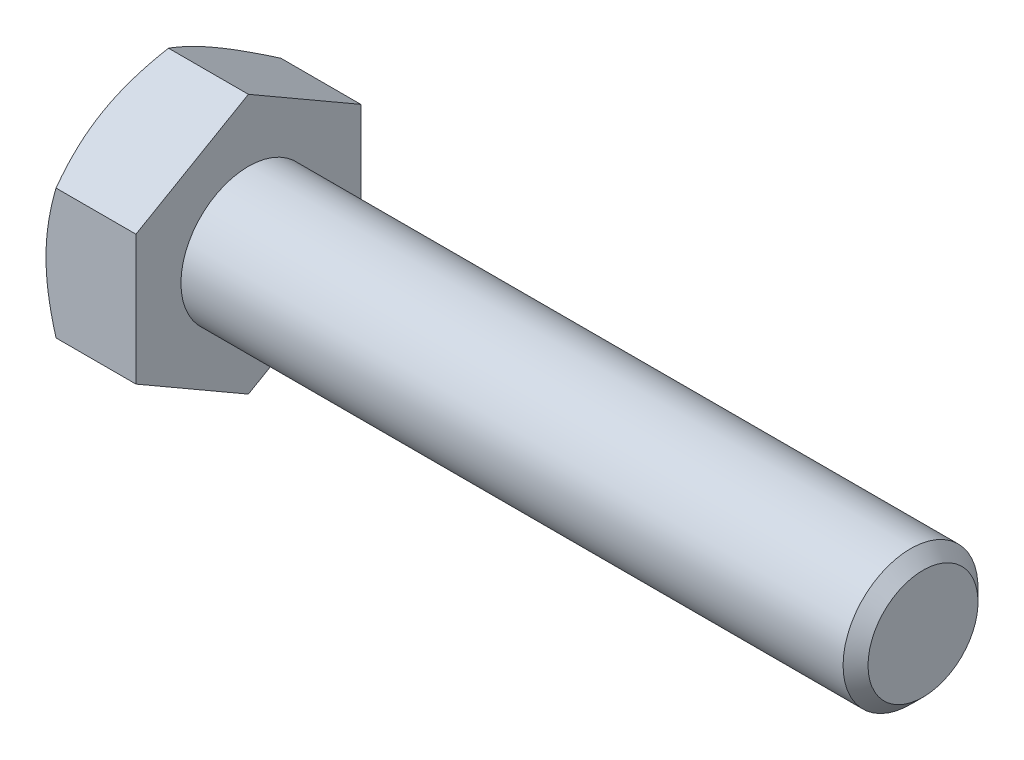
ISO-10303-21;
HEADER;
FILE_DESCRIPTION(('STEP AP214'),'2;1');
FILE_NAME('part.step','',(''),(''),'','','');
FILE_SCHEMA(('AUTOMOTIVE_DESIGN { 1 0 10303 214 1 1 1 1 }'));
ENDSEC;
DATA;
#1=APPLICATION_CONTEXT('core data for automotive mechanical design processes');
#2=APPLICATION_PROTOCOL_DEFINITION('international standard','automotive_design',2000,#1);
#3=PRODUCT_CONTEXT('',#1,'mechanical');
#4=PRODUCT('Part','Part','',(#3));
#5=PRODUCT_RELATED_PRODUCT_CATEGORY('part','',(#4));
#6=PRODUCT_DEFINITION_FORMATION('','',#4);
#7=PRODUCT_DEFINITION_CONTEXT('part definition',#1,'design');
#8=PRODUCT_DEFINITION('design','',#6,#7);
#9=PRODUCT_DEFINITION_SHAPE('','',#8);
#10=(LENGTH_UNIT() NAMED_UNIT(*) SI_UNIT(.MILLI.,.METRE.));
#11=(NAMED_UNIT(*) PLANE_ANGLE_UNIT() SI_UNIT($,.RADIAN.));
#12=(NAMED_UNIT(*) SI_UNIT($,.STERADIAN.) SOLID_ANGLE_UNIT());
#13=UNCERTAINTY_MEASURE_WITH_UNIT(LENGTH_MEASURE(1.E-05),#10,'distance_accuracy_value','');
#14=(GEOMETRIC_REPRESENTATION_CONTEXT(3) GLOBAL_UNCERTAINTY_ASSIGNED_CONTEXT((#13)) GLOBAL_UNIT_ASSIGNED_CONTEXT((#10,
#11,#12)) REPRESENTATION_CONTEXT('',''));
#15=CARTESIAN_POINT('',(0.,0.,0.));
#16=DIRECTION('',(0.,0.,1.));
#17=DIRECTION('',(1.,0.,0.));
#18=AXIS2_PLACEMENT_3D('',#15,#16,#17);
#19=CARTESIAN_POINT('',(4.,2.88675134594812,-5.));
#20=DIRECTION('',(0.,-0.866025403784438,0.500000000000001));
#21=DIRECTION('',(0.,-0.500000000000001,-0.866025403784438));
#22=AXIS2_PLACEMENT_3D('',#19,#20,#21);
#23=PLANE('',#22);
#24=CARTESIAN_POINT('',(0.446648656051831,5.7736181619501,0.000199999999999986));
#25=CARTESIAN_POINT('',(0.373386567637636,5.64675433465071,-0.219534594525184));
#26=CARTESIAN_POINT('',(0.306751321918093,5.5188054379059,-0.44114858445958));
#27=CARTESIAN_POINT('',(0.190438991010812,5.26069210252318,-0.888213995453513));
#28=CARTESIAN_POINT('',(0.14080304991579,5.13052307794721,-1.11367335959077));
#29=CARTESIAN_POINT('',(0.0635510254186987,4.87177839004641,-1.56183230522351));
#30=CARTESIAN_POINT('',(0.0354203782834898,4.74324302208387,-1.78446209310419));
#31=CARTESIAN_POINT('',(0.0101949219536844,4.54998783160116,-2.11918990184664));
#32=CARTESIAN_POINT('',(0.00461345976948374,4.48552534905128,-2.23084219680506));
#33=CARTESIAN_POINT('',(-0.000797783248530163,4.35654081066911,-2.4542499706738));
#34=CARTESIAN_POINT('',(-0.000627741741796996,4.2920187567385,-2.56600544629031));
#35=CARTESIAN_POINT('',(0.0077536317920361,4.11524635305244,-2.87218423085064));
#36=CARTESIAN_POINT('',(0.021829771897251,4.00305457769146,-3.06650608596721));
#37=CARTESIAN_POINT('',(0.06646525710943,3.77941563226457,-3.4538601019977));
#38=CARTESIAN_POINT('',(0.0970398601475071,3.66796924828418,-3.64689090137157));
#39=CARTESIAN_POINT('',(0.173468493621162,3.44387972423144,-4.03502534247485));
#40=CARTESIAN_POINT('',(0.219646378878679,3.3312648659868,-4.23007999864174));
#41=CARTESIAN_POINT('',(0.324451794491933,3.1077146415794,-4.61728034535877));
#42=CARTESIAN_POINT('',(0.383054703437373,2.99677641204846,-4.80943099540809));
#43=CARTESIAN_POINT('',(0.446648656051827,2.88663587589429,-5.0002));
#44=B_SPLINE_CURVE_WITH_KNOTS('',3,(#24,#25,#26,#27,#28,#29,#30,#31,#32,#33,#34,#35,#36,#37,#38,
#39,#40,#41,#42,#43),.UNSPECIFIED.,.F.,.F.,(4,2,2,2,2,2,2,2,2,4),(0.,0.792555841363091,
1.58701660053334,2.36181537487281,2.74884076077326,3.13585419177295,3.80962362599679,
4.48401723901189,5.17336882348929,5.86136694793726),.UNSPECIFIED.);
#45=CARTESIAN_POINT('',(0.446581987385204,5.77350269189626,0.));
#46=VERTEX_POINT('',#45);
#47=CARTESIAN_POINT('',(0.,4.33012701892219,-2.50000000000001));
#48=VERTEX_POINT('',#47);
#49=EDGE_CURVE('E52',#46,#48,#44,.T.);
#50=ORIENTED_EDGE('',*,*,#49,.F.);
#51=DIRECTION('',(-1.,0.,0.));
#52=VECTOR('',#51,1.);
#53=CARTESIAN_POINT('',(4.,5.77350269189626,0.));
#54=LINE('',#53,#52);
#55=CARTESIAN_POINT('',(4.,5.77350269189626,0.));
#56=VERTEX_POINT('',#55);
#57=EDGE_CURVE('E148',#56,#46,#54,.T.);
#58=ORIENTED_EDGE('',*,*,#57,.F.);
#59=DIRECTION('',(0.,0.500000000000001,0.866025403784438));
#60=VECTOR('',#59,1.);
#61=CARTESIAN_POINT('',(4.,2.88675134594812,-5.));
#62=LINE('',#61,#60);
#63=CARTESIAN_POINT('',(4.,2.88675134594812,-5.));
#64=VERTEX_POINT('',#63);
#65=EDGE_CURVE('E233',#64,#56,#62,.T.);
#66=ORIENTED_EDGE('',*,*,#65,.F.);
#67=DIRECTION('',(-1.,0.,0.));
#68=VECTOR('',#67,1.);
#69=CARTESIAN_POINT('',(4.,2.88675134594812,-5.));
#70=LINE('',#69,#68);
#71=CARTESIAN_POINT('',(0.4465819873852,2.88675134594812,-5.));
#72=VERTEX_POINT('',#71);
#73=EDGE_CURVE('E136',#64,#72,#70,.T.);
#74=ORIENTED_EDGE('',*,*,#73,.T.);
#75=EDGE_CURVE('E130',#48,#72,#44,.T.);
#76=ORIENTED_EDGE('',*,*,#75,.F.);
#77=EDGE_LOOP('',(#50,#58,#66,#74,#76));
#78=FACE_BOUND('',#77,.T.);
#79=ADVANCED_FACE('F36',(#78),#23,.F.);
#80=CARTESIAN_POINT('',(4.,5.77350269189626,0.));
#81=DIRECTION('',(0.,-0.866025403784438,-0.500000000000001));
#82=DIRECTION('',(0.,0.500000000000001,-0.866025403784438));
#83=AXIS2_PLACEMENT_3D('',#80,#81,#82);
#84=PLANE('',#83);
#85=CARTESIAN_POINT('',(0.446648656051828,2.88663587589429,5.0002));
#86=CARTESIAN_POINT('',(0.373386567637634,3.01349970319368,4.78046540547482));
#87=CARTESIAN_POINT('',(0.306751321918091,3.14144859993849,4.55885141554042));
#88=CARTESIAN_POINT('',(0.19043899101081,3.3995619353212,4.11178600454649));
#89=CARTESIAN_POINT('',(0.140803049915789,3.52973095989717,3.88632664040923));
#90=CARTESIAN_POINT('',(0.0635510254186978,3.78847564779797,3.43816769477649));
#91=CARTESIAN_POINT('',(0.0354203782834894,3.91701101576052,3.21553790689581));
#92=CARTESIAN_POINT('',(0.0101949219536847,4.11026620624322,2.88081009815336));
#93=CARTESIAN_POINT('',(0.00461345976948418,4.17472868879311,2.76915780319494));
#94=CARTESIAN_POINT('',(-0.000797783248529596,4.30371322717528,2.5457500293262));
#95=CARTESIAN_POINT('',(-0.000627741741796505,4.36823528110589,2.43399455370969));
#96=CARTESIAN_POINT('',(0.00775363179203663,4.54500768479194,2.12781576914936));
#97=CARTESIAN_POINT('',(0.0218297718972519,4.65719946015293,1.93349391403279));
#98=CARTESIAN_POINT('',(0.0664652571094317,4.88083840557981,1.5461398980023));
#99=CARTESIAN_POINT('',(0.0970398601475093,4.9922847895602,1.35310909862843));
#100=CARTESIAN_POINT('',(0.173468493621165,5.21637431361295,0.964974657525146));
#101=CARTESIAN_POINT('',(0.219646378878682,5.32898917185759,0.769920001358265));
#102=CARTESIAN_POINT('',(0.324451794491936,5.55253939626498,0.382719654641232));
#103=CARTESIAN_POINT('',(0.383054703437376,5.66347762579592,0.190569004591913));
#104=CARTESIAN_POINT('',(0.446648656051831,5.7736181619501,-0.000200000000000144));
#105=B_SPLINE_CURVE_WITH_KNOTS('',3,(#85,#86,#87,#88,#89,#90,#91,#92,#93,#94,#95,#96,#97,#98,
#99,#100,#101,#102,#103,#104),.UNSPECIFIED.,.F.,.F.,(4,2,2,2,2,2,2,2,2,4),(0.,0.792555841363091,
1.58701660053333,2.36181537487281,2.74884076077325,3.13585419177295,3.80962362599679,
4.48401723901189,5.17336882348929,5.86136694793726),.UNSPECIFIED.);
#106=CARTESIAN_POINT('',(0.446581987385201,2.88675134594812,5.));
#107=VERTEX_POINT('',#106);
#108=CARTESIAN_POINT('',(0.,4.33012701892219,2.5));
#109=VERTEX_POINT('',#108);
#110=EDGE_CURVE('E59',#107,#109,#105,.T.);
#111=ORIENTED_EDGE('',*,*,#110,.F.);
#112=DIRECTION('',(-1.,0.,0.));
#113=VECTOR('',#112,1.);
#114=CARTESIAN_POINT('',(4.,2.88675134594813,5.));
#115=LINE('',#114,#113);
#116=CARTESIAN_POINT('',(4.,2.88675134594813,5.));
#117=VERTEX_POINT('',#116);
#118=EDGE_CURVE('E146',#117,#107,#115,.T.);
#119=ORIENTED_EDGE('',*,*,#118,.F.);
#120=DIRECTION('',(0.,-0.500000000000001,0.866025403784438));
#121=VECTOR('',#120,1.);
#122=CARTESIAN_POINT('',(4.,5.77350269189626,0.));
#123=LINE('',#122,#121);
#124=EDGE_CURVE('E231',#56,#117,#123,.T.);
#125=ORIENTED_EDGE('',*,*,#124,.F.);
#126=ORIENTED_EDGE('',*,*,#57,.T.);
#127=EDGE_CURVE('E163',#109,#46,#105,.T.);
#128=ORIENTED_EDGE('',*,*,#127,.F.);
#129=EDGE_LOOP('',(#111,#119,#125,#126,#128));
#130=FACE_BOUND('',#129,.T.);
#131=ADVANCED_FACE('F169',(#130),#84,.F.);
#132=CARTESIAN_POINT('',(4.,2.88675134594813,5.));
#133=DIRECTION('',(0.,0.,-1.));
#134=DIRECTION('',(0.,1.,0.));
#135=AXIS2_PLACEMENT_3D('',#132,#133,#134);
#136=PLANE('',#135);
#137=CARTESIAN_POINT('',(2.47533544689295,-7.82661640313889,5.));
#138=CARTESIAN_POINT('',(2.36879683507773,-7.60758613024921,5.));
#139=CARTESIAN_POINT('',(2.26325911833056,-7.3880607136441,5.));
#140=CARTESIAN_POINT('',(2.0547470786595,-6.94775649535433,5.));
#141=CARTESIAN_POINT('',(1.95177314617002,-6.72697750897688,5.));
#142=CARTESIAN_POINT('',(1.74844778545274,-6.28280027125597,5.));
#143=CARTESIAN_POINT('',(1.64811306490869,-6.05939434592713,5.));
#144=CARTESIAN_POINT('',(1.45145486004312,-5.6108304383292,5.));
#145=CARTESIAN_POINT('',(1.35513119080617,-5.38567253739804,5.));
#146=CARTESIAN_POINT('',(1.1644503760596,-4.92576614780202,5.));
#147=CARTESIAN_POINT('',(1.07026351405995,-4.69094667859484,5.));
#148=CARTESIAN_POINT('',(0.888844387350835,-4.21858752735362,5.));
#149=CARTESIAN_POINT('',(0.801612892640657,-3.98104754746317,5.));
#150=CARTESIAN_POINT('',(0.636341071883238,-3.50329086404363,5.));
#151=CARTESIAN_POINT('',(0.558282765149709,-3.26308044250486,5.));
#152=CARTESIAN_POINT('',(0.413813856737663,-2.77921467819531,5.));
#153=CARTESIAN_POINT('',(0.347399663631973,-2.53556042275999,5.));
#154=CARTESIAN_POINT('',(0.22970745053505,-2.04600448312503,5.));
#155=CARTESIAN_POINT('',(0.178346573442477,-1.80012308686183,5.));
#156=CARTESIAN_POINT('',(0.0936230804935142,-1.30522837494365,5.));
#157=CARTESIAN_POINT('',(0.0602585789244918,-1.05621539022477,5.));
#158=CARTESIAN_POINT('',(0.0146229933804843,-0.559584253783065,5.));
#159=CARTESIAN_POINT('',(0.00207498506584115,-0.311992192967673,5.));
#160=CARTESIAN_POINT('',(-0.0015974716503048,0.18337558405674,5.));
#161=CARTESIAN_POINT('',(0.00727849448086283,0.431151303726643,5.));
#162=CARTESIAN_POINT('',(0.0397265053205848,0.84962286075823,5.));
#163=CARTESIAN_POINT('',(0.0579847912618802,1.02075746544157,5.));
#164=CARTESIAN_POINT('',(0.103624049996723,1.3618139875752,5.));
#165=CARTESIAN_POINT('',(0.131006199082925,1.53173574577271,5.));
#166=CARTESIAN_POINT('',(0.225403333816323,2.03942834541587,5.));
#167=CARTESIAN_POINT('',(0.304653621104038,2.37495177168563,5.));
#168=CARTESIAN_POINT('',(0.442611792168641,2.87686006020152,5.));
#169=CARTESIAN_POINT('',(0.492453035928118,3.04583048582565,5.));
#170=CARTESIAN_POINT('',(0.597441969480142,3.38213061038659,5.));
#171=CARTESIAN_POINT('',(0.652589698776807,3.54946029709869,5.));
#172=CARTESIAN_POINT('',(0.767295730006399,3.88253122341817,5.));
#173=CARTESIAN_POINT('',(0.826852713137817,4.04827292137365,5.));
#174=CARTESIAN_POINT('',(0.949663499110053,4.37837269604184,5.));
#175=CARTESIAN_POINT('',(1.01291722636637,4.54273080096526,5.));
#176=CARTESIAN_POINT('',(1.18384085306905,4.9746759403977,5.));
#177=CARTESIAN_POINT('',(1.29410564783453,5.24123504256648,5.));
#178=CARTESIAN_POINT('',(1.52085041203993,5.77170603526334,5.));
#179=CARTESIAN_POINT('',(1.63733099805397,6.03561766007928,5.));
#180=CARTESIAN_POINT('',(1.87507624393349,6.56138078778337,5.));
#181=CARTESIAN_POINT('',(1.99634255328238,6.82323154239329,5.));
#182=CARTESIAN_POINT('',(2.24254703861693,7.34518395602015,5.));
#183=CARTESIAN_POINT('',(2.36748508200602,7.60528567778374,5.));
#184=CARTESIAN_POINT('',(2.62044102887898,8.12446478659922,5.));
#185=CARTESIAN_POINT('',(2.74846325062126,8.38354006552432,5.));
#186=CARTESIAN_POINT('',(3.00682668967549,8.9005329112754,5.));
#187=CARTESIAN_POINT('',(3.13716793074432,9.15845046620729,5.));
#188=CARTESIAN_POINT('',(3.53092424591317,9.93067662274979,5.));
#189=CARTESIAN_POINT('',(3.79712405172275,10.4435647238032,5.));
#190=CARTESIAN_POINT('',(4.3072404688117,11.4147548711532,5.));
#191=CARTESIAN_POINT('',(4.55067498762245,11.873311348306,5.));
#192=CARTESIAN_POINT('',(5.04052915785298,12.7888590468283,5.));
#193=CARTESIAN_POINT('',(5.28694897482743,13.2458501795696,5.));
#194=CARTESIAN_POINT('',(5.78122505346439,14.1571829390173,5.));
#195=CARTESIAN_POINT('',(6.02907430461245,14.6115283739736,5.));
#196=CARTESIAN_POINT('',(6.5264818551985,15.5192398746589,5.));
#197=CARTESIAN_POINT('',(6.77604002809907,15.9726060096992,5.));
#198=CARTESIAN_POINT('',(7.02622264559118,16.4256251044156,5.00000000000001));
#199=B_SPLINE_CURVE_WITH_KNOTS('',3,(#137,#138,#139,#140,#141,#142,#143,#144,#145,#146,#147,
#148,#149,#150,#151,#152,#153,#154,#155,#156,#157,#158,#159,#160,#161,#162,#163,#164,#165,#166,
#167,#168,#169,#170,#171,#172,#173,#174,#175,#176,#177,#178,#179,#180,#181,#182,#183,#184,#185,
#186,#187,#188,#189,#190,#191,#192,#193,#194,#195,#196,#197,#198),.UNSPECIFIED.,.F.,.F.,(4,2,2,
2,2,2,2,2,2,2,2,2,2,2,2,2,2,2,2,2,2,2,2,2,2,2,2,2,2,2,4),(0.,0.730708682143098,1.46152797033751,
2.19620403652928,2.930846195478,3.68977491658213,4.44878753915767,5.20628666210828,
5.9635517348485,6.71656679485872,7.46950293642267,8.21233991237299,8.95519126159773,
9.47125991232469,9.98739512288342,11.0201893937443,11.5486465414698,12.0771076235976,
12.6054112774226,13.1337041332035,13.9989833719716,14.8643486020619,15.7300147459346,
16.5956496665091,17.4625765068272,18.3295122333794,20.0630293163822,21.6205191219182,
23.1780956996636,24.7307447704824,26.2832800921358),.UNSPECIFIED.);
#200=CARTESIAN_POINT('',(0.446581987385199,-2.88675134594812,5.));
#201=VERTEX_POINT('',#200);
#202=CARTESIAN_POINT('',(0.,0.,5.));
#203=VERTEX_POINT('',#202);
#204=EDGE_CURVE('E243',#201,#203,#199,.T.);
#205=ORIENTED_EDGE('',*,*,#204,.F.);
#206=DIRECTION('',(-1.,0.,0.));
#207=VECTOR('',#206,1.);
#208=CARTESIAN_POINT('',(4.,-2.88675134594812,5.));
#209=LINE('',#208,#207);
#210=CARTESIAN_POINT('',(4.,-2.88675134594812,5.));
#211=VERTEX_POINT('',#210);
#212=EDGE_CURVE('E138',#211,#201,#209,.T.);
#213=ORIENTED_EDGE('',*,*,#212,.F.);
#214=DIRECTION('',(0.,-1.,0.));
#215=VECTOR('',#214,1.);
#216=CARTESIAN_POINT('',(4.,2.88675134594813,5.));
#217=LINE('',#216,#215);
#218=EDGE_CURVE('E227',#117,#211,#217,.T.);
#219=ORIENTED_EDGE('',*,*,#218,.F.);
#220=ORIENTED_EDGE('',*,*,#118,.T.);
#221=EDGE_CURVE('E185',#203,#107,#199,.T.);
#222=ORIENTED_EDGE('',*,*,#221,.F.);
#223=EDGE_LOOP('',(#205,#213,#219,#220,#222));
#224=FACE_BOUND('',#223,.T.);
#225=ADVANCED_FACE('F249',(#224),#136,.F.);
#226=CARTESIAN_POINT('',(4.,-5.77350269189626,0.));
#227=DIRECTION('',(0.,0.866025403784438,-0.500000000000002));
#228=DIRECTION('',(0.,0.500000000000002,0.866025403784437));
#229=AXIS2_PLACEMENT_3D('',#226,#227,#228);
#230=PLANE('',#229);
#231=CARTESIAN_POINT('',(0.446648656051832,-5.7736181619501,-0.000200000000000053));
#232=CARTESIAN_POINT('',(0.373386567637638,-5.64675433465071,0.219534594525185));
#233=CARTESIAN_POINT('',(0.306751321918095,-5.5188054379059,0.441148584459581));
#234=CARTESIAN_POINT('',(0.190438991010813,-5.26069210252318,0.888213995453513));
#235=CARTESIAN_POINT('',(0.140803049915791,-5.13052307794721,1.11367335959077));
#236=CARTESIAN_POINT('',(0.063551025418699,-4.87177839004641,1.56183230522351));
#237=CARTESIAN_POINT('',(0.03542037828349,-4.74324302208387,1.78446209310419));
#238=CARTESIAN_POINT('',(0.0101949219536843,-4.54998783160116,2.11918990184664));
#239=CARTESIAN_POINT('',(0.00461345976948345,-4.48552534905128,2.23084219680506));
#240=CARTESIAN_POINT('',(-0.000797783248530365,-4.35654081066911,2.4542499706738));
#241=CARTESIAN_POINT('',(-0.000627741741796937,-4.2920187567385,2.56600544629031));
#242=CARTESIAN_POINT('',(0.00775363179203635,-4.11524635305244,2.87218423085064));
#243=CARTESIAN_POINT('',(0.0218297718972508,-4.00305457769146,3.06650608596721));
#244=CARTESIAN_POINT('',(0.0664652571094294,-3.77941563226457,3.4538601019977));
#245=CARTESIAN_POINT('',(0.0970398601475065,-3.66796924828418,3.64689090137157));
#246=CARTESIAN_POINT('',(0.173468493621162,-3.44387972423143,4.03502534247485));
#247=CARTESIAN_POINT('',(0.219646378878678,-3.33126486598679,4.23007999864174));
#248=CARTESIAN_POINT('',(0.324451794491932,-3.1077146415794,4.61728034535877));
#249=CARTESIAN_POINT('',(0.383054703437371,-2.99677641204846,4.80943099540809));
#250=CARTESIAN_POINT('',(0.446648656051825,-2.88663587589428,5.0002));
#251=B_SPLINE_CURVE_WITH_KNOTS('',3,(#231,#232,#233,#234,#235,#236,#237,#238,#239,#240,#241,
#242,#243,#244,#245,#246,#247,#248,#249,#250),.UNSPECIFIED.,.F.,.F.,(4,2,2,2,2,2,2,2,2,4),(0.,
0.792555841363092,1.58701660053334,2.36181537487281,2.74884076077326,3.13585419177295,
3.8096236259968,4.4840172390119,5.17336882348929,5.86136694793726),.UNSPECIFIED.);
#252=CARTESIAN_POINT('',(0.446581987385206,-5.77350269189626,0.));
#253=VERTEX_POINT('',#252);
#254=CARTESIAN_POINT('',(0.,-4.33012701892219,2.50000000000001));
#255=VERTEX_POINT('',#254);
#256=EDGE_CURVE('E171',#253,#255,#251,.T.);
#257=ORIENTED_EDGE('',*,*,#256,.F.);
#258=DIRECTION('',(-1.,0.,0.));
#259=VECTOR('',#258,1.);
#260=CARTESIAN_POINT('',(4.,-5.77350269189626,0.));
#261=LINE('',#260,#259);
#262=CARTESIAN_POINT('',(4.,-5.77350269189626,0.));
#263=VERTEX_POINT('',#262);
#264=EDGE_CURVE('E135',#263,#253,#261,.T.);
#265=ORIENTED_EDGE('',*,*,#264,.F.);
#266=DIRECTION('',(0.,-0.500000000000002,-0.866025403784437));
#267=VECTOR('',#266,1.);
#268=CARTESIAN_POINT('',(4.,-5.77350269189626,0.));
#269=LINE('',#268,#267);
#270=EDGE_CURVE('E225',#211,#263,#269,.T.);
#271=ORIENTED_EDGE('',*,*,#270,.F.);
#272=ORIENTED_EDGE('',*,*,#212,.T.);
#273=EDGE_CURVE('E173',#255,#201,#251,.T.);
#274=ORIENTED_EDGE('',*,*,#273,.F.);
#275=EDGE_LOOP('',(#257,#265,#271,#272,#274));
#276=FACE_BOUND('',#275,.T.);
#277=ADVANCED_FACE('F221',(#276),#230,.F.);
#278=CARTESIAN_POINT('',(4.,-2.88675134594813,-5.));
#279=DIRECTION('',(0.,0.866025403784439,0.5));
#280=DIRECTION('',(0.,-0.5,0.866025403784439));
#281=AXIS2_PLACEMENT_3D('',#278,#279,#280);
#282=PLANE('',#281);
#283=CARTESIAN_POINT('',(0.44664865605183,-2.8866358758943,-5.0002));
#284=CARTESIAN_POINT('',(0.373386567637636,-3.01349970319369,-4.78046540547482));
#285=CARTESIAN_POINT('',(0.306751321918093,-3.1414485999385,-4.55885141554042));
#286=CARTESIAN_POINT('',(0.190438991010813,-3.39956193532121,-4.11178600454649));
#287=CARTESIAN_POINT('',(0.140803049915791,-3.52973095989718,-3.88632664040923));
#288=CARTESIAN_POINT('',(0.0635510254187004,-3.78847564779798,-3.43816769477649));
#289=CARTESIAN_POINT('',(0.0354203782834919,-3.91701101576052,-3.21553790689581));
#290=CARTESIAN_POINT('',(0.0101949219536874,-4.11026620624323,-2.88081009815336));
#291=CARTESIAN_POINT('',(0.00461345976948698,-4.17472868879311,-2.76915780319494));
#292=CARTESIAN_POINT('',(-0.000797783248526409,-4.30371322717528,-2.5457500293262));
#293=CARTESIAN_POINT('',(-0.000627741741793026,-4.36823528110589,-2.43399455370968));
#294=CARTESIAN_POINT('',(0.0077536317920405,-4.54500768479195,-2.12781576914936));
#295=CARTESIAN_POINT('',(0.0218297718972554,-4.65719946015293,-1.93349391403278));
#296=CARTESIAN_POINT('',(0.0664652571094348,-4.88083840557982,-1.54613989800229));
#297=CARTESIAN_POINT('',(0.0970398601475121,-4.99228478956021,-1.35310909862843));
#298=CARTESIAN_POINT('',(0.173468493621168,-5.21637431361295,-0.964974657525145));
#299=CARTESIAN_POINT('',(0.219646378878684,-5.32898917185759,-0.769920001358263));
#300=CARTESIAN_POINT('',(0.324451794491938,-5.55253939626499,-0.382719654641231));
#301=CARTESIAN_POINT('',(0.383054703437378,-5.66347762579592,-0.190569004591913));
#302=CARTESIAN_POINT('',(0.446648656051832,-5.7736181619501,0.000200000000000639));
#303=B_SPLINE_CURVE_WITH_KNOTS('',3,(#283,#284,#285,#286,#287,#288,#289,#290,#291,#292,#293,
#294,#295,#296,#297,#298,#299,#300,#301,#302),.UNSPECIFIED.,.F.,.F.,(4,2,2,2,2,2,2,2,2,4),(0.,
0.79255584136309,1.58701660053333,2.36181537487281,2.74884076077325,3.13585419177295,
3.80962362599679,4.48401723901189,5.17336882348929,5.86136694793725),.UNSPECIFIED.);
#304=CARTESIAN_POINT('',(0.446581987384949,-2.88675134594852,-5.));
#305=VERTEX_POINT('',#304);
#306=CARTESIAN_POINT('',(0.,-4.33012701892219,-2.5));
#307=VERTEX_POINT('',#306);
#308=EDGE_CURVE('E112',#305,#307,#303,.T.);
#309=ORIENTED_EDGE('',*,*,#308,.F.);
#310=DIRECTION('',(-1.,0.,0.));
#311=VECTOR('',#310,1.);
#312=CARTESIAN_POINT('',(4.,-2.88675134594813,-5.));
#313=LINE('',#312,#311);
#314=CARTESIAN_POINT('',(4.,-2.88675134594813,-5.));
#315=VERTEX_POINT('',#314);
#316=EDGE_CURVE('E126',#315,#305,#313,.T.);
#317=ORIENTED_EDGE('',*,*,#316,.F.);
#318=DIRECTION('',(0.,0.5,-0.866025403784439));
#319=VECTOR('',#318,1.);
#320=CARTESIAN_POINT('',(4.,-2.88675134594813,-5.));
#321=LINE('',#320,#319);
#322=EDGE_CURVE('E223',#263,#315,#321,.T.);
#323=ORIENTED_EDGE('',*,*,#322,.F.);
#324=ORIENTED_EDGE('',*,*,#264,.T.);
#325=EDGE_CURVE('E129',#307,#253,#303,.T.);
#326=ORIENTED_EDGE('',*,*,#325,.F.);
#327=EDGE_LOOP('',(#309,#317,#323,#324,#326));
#328=FACE_BOUND('',#327,.T.);
#329=ADVANCED_FACE('F124',(#328),#282,.F.);
#330=CARTESIAN_POINT('',(4.,2.88675134594812,-5.));
#331=DIRECTION('',(0.,0.,1.));
#332=DIRECTION('',(1.,0.,0.));
#333=AXIS2_PLACEMENT_3D('',#330,#331,#332);
#334=PLANE('',#333);
#335=CARTESIAN_POINT('',(2.47533544689296,-7.82661640313891,-5.));
#336=CARTESIAN_POINT('',(2.36879683507773,-7.60758613024923,-5.));
#337=CARTESIAN_POINT('',(2.26325911833057,-7.38806071364412,-5.));
#338=CARTESIAN_POINT('',(2.05474707865951,-6.94775649535435,-5.));
#339=CARTESIAN_POINT('',(1.95177314617003,-6.7269775089769,-5.));
#340=CARTESIAN_POINT('',(1.74844778545275,-6.28280027125599,-5.));
#341=CARTESIAN_POINT('',(1.64811306490869,-6.05939434592714,-5.));
#342=CARTESIAN_POINT('',(1.45145486004312,-5.61083043832922,-5.));
#343=CARTESIAN_POINT('',(1.35513119080618,-5.38567253739806,-5.));
#344=CARTESIAN_POINT('',(1.16445037605961,-4.92576614780204,-5.));
#345=CARTESIAN_POINT('',(1.07026351405996,-4.69094667859486,-5.));
#346=CARTESIAN_POINT('',(0.888844387350842,-4.21858752735364,-5.));
#347=CARTESIAN_POINT('',(0.801612892640663,-3.98104754746318,-5.));
#348=CARTESIAN_POINT('',(0.636341071883243,-3.50329086404365,-5.));
#349=CARTESIAN_POINT('',(0.558282765149714,-3.26308044250488,-5.));
#350=CARTESIAN_POINT('',(0.413813856737668,-2.77921467819533,-5.));
#351=CARTESIAN_POINT('',(0.347399663631977,-2.53556042276,-5.));
#352=CARTESIAN_POINT('',(0.229707450535054,-2.04600448312504,-5.));
#353=CARTESIAN_POINT('',(0.178346573442481,-1.80012308686184,-5.));
#354=CARTESIAN_POINT('',(0.0936230804935165,-1.30522837494366,-5.));
#355=CARTESIAN_POINT('',(0.0602585789244934,-1.05621539022478,-5.));
#356=CARTESIAN_POINT('',(0.014622993380485,-0.559584253783075,-5.));
#357=CARTESIAN_POINT('',(0.0020749850658414,-0.311992192967682,-5.));
#358=CARTESIAN_POINT('',(-0.00159747165030502,0.183375584056731,-5.));
#359=CARTESIAN_POINT('',(0.00727849448086254,0.431151303726634,-5.));
#360=CARTESIAN_POINT('',(0.0397265053205839,0.849622860758221,-5.));
#361=CARTESIAN_POINT('',(0.0579847912618789,1.02075746544156,-5.));
#362=CARTESIAN_POINT('',(0.103624049996721,1.36181398757519,-5.));
#363=CARTESIAN_POINT('',(0.131006199082923,1.5317357457727,-5.));
#364=CARTESIAN_POINT('',(0.225403333816321,2.03942834541586,-5.));
#365=CARTESIAN_POINT('',(0.304653621104034,2.37495177168562,-5.));
#366=CARTESIAN_POINT('',(0.442611792168636,2.87686006020151,-5.));
#367=CARTESIAN_POINT('',(0.492453035928113,3.04583048582564,-5.));
#368=CARTESIAN_POINT('',(0.597441969480137,3.38213061038658,-5.));
#369=CARTESIAN_POINT('',(0.652589698776802,3.54946029709868,-5.));
#370=CARTESIAN_POINT('',(0.767295730006393,3.88253122341816,-5.));
#371=CARTESIAN_POINT('',(0.826852713137811,4.04827292137363,-5.));
#372=CARTESIAN_POINT('',(0.949663499110047,4.37837269604182,-5.));
#373=CARTESIAN_POINT('',(1.01291722636637,4.54273080096525,-5.));
#374=CARTESIAN_POINT('',(1.18384085306905,4.97467594039768,-5.));
#375=CARTESIAN_POINT('',(1.29410564783452,5.24123504256647,-5.));
#376=CARTESIAN_POINT('',(1.52085041203992,5.77170603526333,-5.));
#377=CARTESIAN_POINT('',(1.63733099805396,6.03561766007927,-5.));
#378=CARTESIAN_POINT('',(1.87507624393348,6.56138078778336,-5.));
#379=CARTESIAN_POINT('',(1.99634255328237,6.82323154239328,-5.));
#380=CARTESIAN_POINT('',(2.24254703861692,7.34518395602014,-5.));
#381=CARTESIAN_POINT('',(2.36748508200601,7.60528567778373,-5.));
#382=CARTESIAN_POINT('',(2.62044102887897,8.12446478659921,-5.));
#383=CARTESIAN_POINT('',(2.74846325062125,8.38354006552432,-5.));
#384=CARTESIAN_POINT('',(3.00682668967549,8.9005329112754,-5.));
#385=CARTESIAN_POINT('',(3.13716793074432,9.15845046620728,-5.));
#386=CARTESIAN_POINT('',(3.53092424591316,9.93067662274979,-5.));
#387=CARTESIAN_POINT('',(3.79712405172275,10.4435647238032,-5.));
#388=CARTESIAN_POINT('',(4.3072404688117,11.4147548711532,-5.));
#389=CARTESIAN_POINT('',(4.55067498762245,11.873311348306,-5.));
#390=CARTESIAN_POINT('',(5.04052915785298,12.7888590468283,-5.));
#391=CARTESIAN_POINT('',(5.28694897482743,13.2458501795696,-5.));
#392=CARTESIAN_POINT('',(5.7812250534644,14.1571829390173,-5.));
#393=CARTESIAN_POINT('',(6.02907430461245,14.6115283739736,-5.));
#394=CARTESIAN_POINT('',(6.5264818551985,15.5192398746589,-5.));
#395=CARTESIAN_POINT('',(6.77604002809907,15.9726060096992,-5.));
#396=CARTESIAN_POINT('',(7.02622264559118,16.4256251044156,-5.));
#397=B_SPLINE_CURVE_WITH_KNOTS('',3,(#335,#336,#337,#338,#339,#340,#341,#342,#343,#344,#345,
#346,#347,#348,#349,#350,#351,#352,#353,#354,#355,#356,#357,#358,#359,#360,#361,#362,#363,#364,
#365,#366,#367,#368,#369,#370,#371,#372,#373,#374,#375,#376,#377,#378,#379,#380,#381,#382,#383,
#384,#385,#386,#387,#388,#389,#390,#391,#392,#393,#394,#395,#396),.UNSPECIFIED.,.F.,.F.,(4,2,2,
2,2,2,2,2,2,2,2,2,2,2,2,2,2,2,2,2,2,2,2,2,2,2,2,2,2,2,4),(0.,0.730708682143099,1.46152797033751,
2.19620403652929,2.930846195478,3.68977491658213,4.44878753915767,5.20628666210828,
5.9635517348485,6.71656679485873,7.46950293642268,8.21233991237301,8.95519126159775,
9.4712599123247,9.98739512288343,11.0201893937443,11.5486465414698,12.0771076235976,
12.6054112774226,13.1337041332035,13.9989833719716,14.8643486020619,15.7300147459346,
16.5956496665091,17.4625765068272,18.3295122333794,20.0630293163822,21.6205191219182,
23.1780956996636,24.7307447704824,26.2832800921359),.UNSPECIFIED.);
#398=CARTESIAN_POINT('',(0.,0.,-5.));
#399=VERTEX_POINT('',#398);
#400=EDGE_CURVE('E118',#72,#399,#397,.F.);
#401=ORIENTED_EDGE('',*,*,#400,.F.);
#402=ORIENTED_EDGE('',*,*,#73,.F.);
#403=DIRECTION('',(0.,1.,0.));
#404=VECTOR('',#403,1.);
#405=CARTESIAN_POINT('',(4.,2.88675134594812,-5.));
#406=LINE('',#405,#404);
#407=EDGE_CURVE('E134',#315,#64,#406,.T.);
#408=ORIENTED_EDGE('',*,*,#407,.F.);
#409=ORIENTED_EDGE('',*,*,#316,.T.);
#410=EDGE_CURVE('E109',#399,#305,#397,.F.);
#411=ORIENTED_EDGE('',*,*,#410,.F.);
#412=EDGE_LOOP('',(#401,#402,#408,#409,#411));
#413=FACE_BOUND('',#412,.T.);
#414=ADVANCED_FACE('F132',(#413),#334,.F.);
#415=CARTESIAN_POINT('',(4.,5.77350269189626,0.));
#416=DIRECTION('',(1.,0.,0.));
#417=DIRECTION('',(0.,0.,-1.));
#418=AXIS2_PLACEMENT_3D('',#415,#416,#417);
#419=PLANE('',#418);
#420=ORIENTED_EDGE('',*,*,#65,.T.);
#421=ORIENTED_EDGE('',*,*,#124,.T.);
#422=ORIENTED_EDGE('',*,*,#218,.T.);
#423=ORIENTED_EDGE('',*,*,#270,.T.);
#424=ORIENTED_EDGE('',*,*,#322,.T.);
#425=ORIENTED_EDGE('',*,*,#407,.T.);
#426=EDGE_LOOP('',(#420,#421,#422,#423,#424,#425));
#427=FACE_BOUND('',#426,.T.);
#428=CARTESIAN_POINT('',(4.,0.,0.));
#429=DIRECTION('',(1.,0.,0.));
#430=DIRECTION('',(0.,0.,-1.));
#431=AXIS2_PLACEMENT_3D('',#428,#429,#430);
#432=CIRCLE('',#431,3.);
#433=CARTESIAN_POINT('',(4.,0.,-3.));
#434=VERTEX_POINT('',#433);
#435=EDGE_CURVE('E236',#434,#434,#432,.F.);
#436=ORIENTED_EDGE('',*,*,#435,.T.);
#437=EDGE_LOOP('',(#436));
#438=FACE_BOUND('',#437,.T.);
#439=ADVANCED_FACE('F251',(#427,#438),#419,.T.);
#440=CARTESIAN_POINT('',(0.,0.,0.));
#441=DIRECTION('',(-1.,0.,0.));
#442=DIRECTION('',(0.,0.,1.));
#443=AXIS2_PLACEMENT_3D('',#440,#441,#442);
#444=CYLINDRICAL_SURFACE('',#443,3.);
#445=ORIENTED_EDGE('',*,*,#435,.F.);
#446=EDGE_LOOP('',(#445));
#447=FACE_BOUND('',#446,.T.);
#448=CARTESIAN_POINT('',(33.4455,0.,0.));
#449=DIRECTION('',(-1.,0.,0.));
#450=DIRECTION('',(0.,0.,1.));
#451=AXIS2_PLACEMENT_3D('',#448,#449,#450);
#452=CIRCLE('',#451,3.);
#453=CARTESIAN_POINT('',(33.4455,0.,3.));
#454=VERTEX_POINT('',#453);
#455=EDGE_CURVE('E239',#454,#454,#452,.T.);
#456=ORIENTED_EDGE('',*,*,#455,.T.);
#457=EDGE_LOOP('',(#456));
#458=FACE_BOUND('',#457,.T.);
#459=ADVANCED_FACE('F283',(#447,#458),#444,.T.);
#460=CARTESIAN_POINT('',(34.,0.,0.));
#461=DIRECTION('',(-1.,0.,0.));
#462=DIRECTION('',(0.,0.,1.));
#463=AXIS2_PLACEMENT_3D('',#460,#461,#462);
#464=CONICAL_SURFACE('',#463,2.4455,0.785398163397442);
#465=ORIENTED_EDGE('',*,*,#455,.F.);
#466=EDGE_LOOP('',(#465));
#467=FACE_BOUND('',#466,.T.);
#468=CARTESIAN_POINT('',(34.,0.,0.));
#469=DIRECTION('',(-1.,0.,0.));
#470=DIRECTION('',(0.,0.,1.));
#471=AXIS2_PLACEMENT_3D('',#468,#469,#470);
#472=CIRCLE('',#471,2.4455);
#473=CARTESIAN_POINT('',(34.,0.,2.4455));
#474=VERTEX_POINT('',#473);
#475=EDGE_CURVE('E241',#474,#474,#472,.T.);
#476=ORIENTED_EDGE('',*,*,#475,.T.);
#477=EDGE_LOOP('',(#476));
#478=FACE_BOUND('',#477,.T.);
#479=ADVANCED_FACE('F285',(#467,#478),#464,.T.);
#480=CARTESIAN_POINT('',(34.,0.,0.));
#481=DIRECTION('',(-1.,0.,0.));
#482=DIRECTION('',(0.,0.,1.));
#483=AXIS2_PLACEMENT_3D('',#480,#481,#482);
#484=PLANE('',#483);
#485=ORIENTED_EDGE('',*,*,#475,.F.);
#486=EDGE_LOOP('',(#485));
#487=FACE_BOUND('',#486,.T.);
#488=ADVANCED_FACE('F198',(#487),#484,.F.);
#489=CARTESIAN_POINT('',(0.,0.,0.));
#490=DIRECTION('',(1.,0.,0.));
#491=DIRECTION('',(0.,0.,-1.));
#492=AXIS2_PLACEMENT_3D('',#489,#490,#491);
#493=CONICAL_SURFACE('',#492,5.,1.0471975511966);
#494=ORIENTED_EDGE('',*,*,#308,.T.);
#495=CARTESIAN_POINT('',(0.,0.,0.));
#496=DIRECTION('',(1.,0.,0.));
#497=DIRECTION('',(0.,0.,-1.));
#498=AXIS2_PLACEMENT_3D('',#495,#496,#497);
#499=CIRCLE('',#498,5.);
#500=EDGE_CURVE('E40',#307,#399,#499,.T.);
#501=ORIENTED_EDGE('',*,*,#500,.T.);
#502=ORIENTED_EDGE('',*,*,#410,.T.);
#503=EDGE_LOOP('',(#494,#501,#502));
#504=FACE_BOUND('',#503,.T.);
#505=ADVANCED_FACE('F111',(#504),#493,.T.);
#506=ORIENTED_EDGE('',*,*,#256,.T.);
#507=EDGE_CURVE('E153',#255,#307,#499,.T.);
#508=ORIENTED_EDGE('',*,*,#507,.T.);
#509=ORIENTED_EDGE('',*,*,#325,.T.);
#510=EDGE_LOOP('',(#506,#508,#509));
#511=FACE_BOUND('',#510,.T.);
#512=ADVANCED_FACE('F197',(#511),#493,.T.);
#513=ORIENTED_EDGE('',*,*,#204,.T.);
#514=EDGE_CURVE('E154',#203,#255,#499,.T.);
#515=ORIENTED_EDGE('',*,*,#514,.T.);
#516=ORIENTED_EDGE('',*,*,#273,.T.);
#517=EDGE_LOOP('',(#513,#515,#516));
#518=FACE_BOUND('',#517,.T.);
#519=ADVANCED_FACE('F192',(#518),#493,.T.);
#520=ORIENTED_EDGE('',*,*,#221,.T.);
#521=ORIENTED_EDGE('',*,*,#110,.T.);
#522=CARTESIAN_POINT('',(0.,0.,0.));
#523=DIRECTION('',(-1.,0.,0.));
#524=DIRECTION('',(0.,0.,1.));
#525=AXIS2_PLACEMENT_3D('',#522,#523,#524);
#526=CIRCLE('',#525,5.);
#527=EDGE_CURVE('E119',#203,#109,#526,.T.);
#528=ORIENTED_EDGE('',*,*,#527,.F.);
#529=EDGE_LOOP('',(#520,#521,#528));
#530=FACE_BOUND('',#529,.T.);
#531=ADVANCED_FACE('F196',(#530),#493,.T.);
#532=ORIENTED_EDGE('',*,*,#127,.T.);
#533=ORIENTED_EDGE('',*,*,#49,.T.);
#534=EDGE_CURVE('E45',#48,#109,#499,.T.);
#535=ORIENTED_EDGE('',*,*,#534,.T.);
#536=EDGE_LOOP('',(#532,#533,#535));
#537=FACE_BOUND('',#536,.T.);
#538=ADVANCED_FACE('F162',(#537),#493,.T.);
#539=ORIENTED_EDGE('',*,*,#75,.T.);
#540=ORIENTED_EDGE('',*,*,#400,.T.);
#541=EDGE_CURVE('E11',#399,#48,#499,.T.);
#542=ORIENTED_EDGE('',*,*,#541,.T.);
#543=EDGE_LOOP('',(#539,#540,#542));
#544=FACE_BOUND('',#543,.T.);
#545=ADVANCED_FACE('F255',(#544),#493,.T.);
#546=CARTESIAN_POINT('',(0.,5.77350269189626,0.));
#547=DIRECTION('',(1.,0.,0.));
#548=DIRECTION('',(0.,0.,-1.));
#549=AXIS2_PLACEMENT_3D('',#546,#547,#548);
#550=PLANE('',#549);
#551=ORIENTED_EDGE('',*,*,#541,.F.);
#552=ORIENTED_EDGE('',*,*,#500,.F.);
#553=ORIENTED_EDGE('',*,*,#507,.F.);
#554=ORIENTED_EDGE('',*,*,#514,.F.);
#555=ORIENTED_EDGE('',*,*,#527,.T.);
#556=ORIENTED_EDGE('',*,*,#534,.F.);
#557=EDGE_LOOP('',(#551,#552,#553,#554,#555,#556));
#558=FACE_BOUND('',#557,.T.);
#559=ADVANCED_FACE('F166',(#558),#550,.F.);
#560=CLOSED_SHELL('',(#79,#131,#225,#277,#329,#414,#439,#459,#479,#488,#505,#512,#519,#531,#538,
#545,#559));
#561=MANIFOLD_SOLID_BREP('B2',#560);
#562=ADVANCED_BREP_SHAPE_REPRESENTATION('',(#18,#561),#14);
#563=SHAPE_DEFINITION_REPRESENTATION(#9,#562);
ENDSEC;
END-ISO-10303-21;
